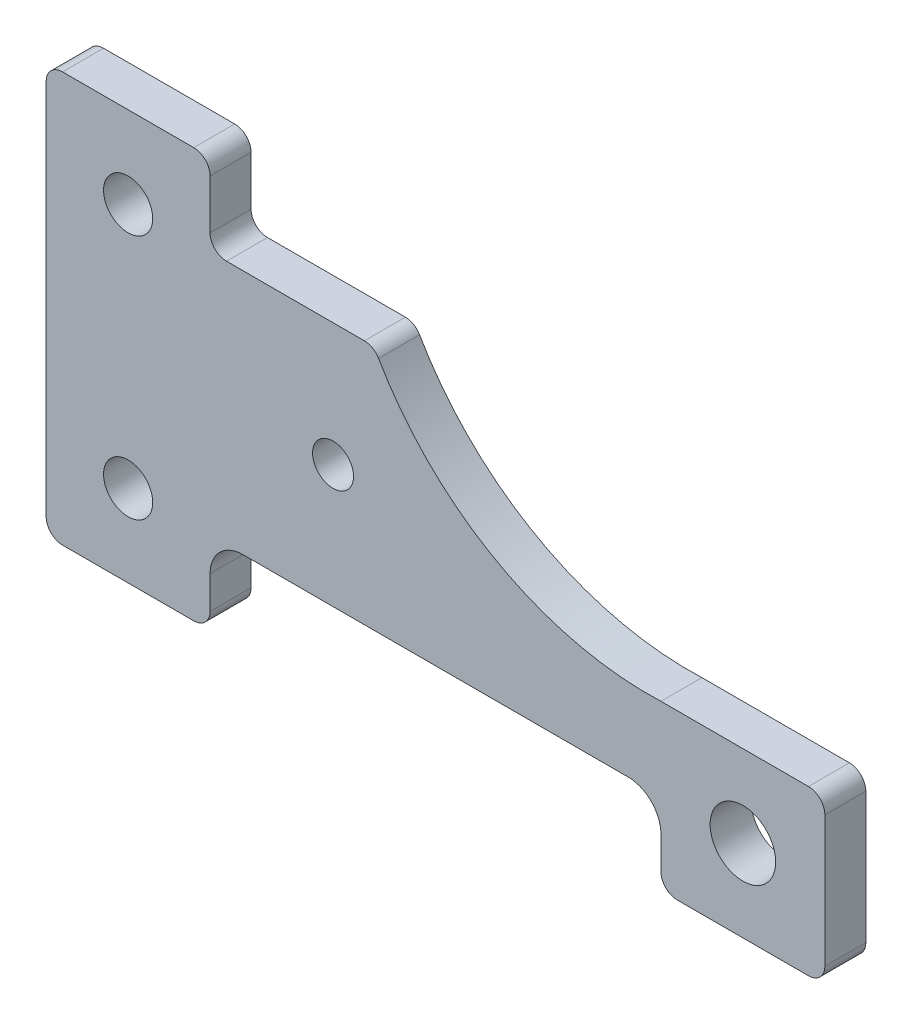
ISO-10303-21;
HEADER;
FILE_DESCRIPTION(('STEP AP214'),'2;1');
FILE_NAME('part.step','',(''),(''),'','','');
FILE_SCHEMA(('AUTOMOTIVE_DESIGN { 1 0 10303 214 1 1 1 1 }'));
ENDSEC;
DATA;
#1=APPLICATION_CONTEXT('core data for automotive mechanical design processes');
#2=APPLICATION_PROTOCOL_DEFINITION('international standard','automotive_design',2000,#1);
#3=PRODUCT_CONTEXT('',#1,'mechanical');
#4=PRODUCT('Part','Part','',(#3));
#5=PRODUCT_RELATED_PRODUCT_CATEGORY('part','',(#4));
#6=PRODUCT_DEFINITION_FORMATION('','',#4);
#7=PRODUCT_DEFINITION_CONTEXT('part definition',#1,'design');
#8=PRODUCT_DEFINITION('design','',#6,#7);
#9=PRODUCT_DEFINITION_SHAPE('','',#8);
#10=(LENGTH_UNIT() NAMED_UNIT(*) SI_UNIT(.MILLI.,.METRE.));
#11=(NAMED_UNIT(*) PLANE_ANGLE_UNIT() SI_UNIT($,.RADIAN.));
#12=(NAMED_UNIT(*) SI_UNIT($,.STERADIAN.) SOLID_ANGLE_UNIT());
#13=UNCERTAINTY_MEASURE_WITH_UNIT(LENGTH_MEASURE(1.E-05),#10,'distance_accuracy_value','');
#14=(GEOMETRIC_REPRESENTATION_CONTEXT(3) GLOBAL_UNCERTAINTY_ASSIGNED_CONTEXT((#13)) GLOBAL_UNIT_ASSIGNED_CONTEXT((#10,
#11,#12)) REPRESENTATION_CONTEXT('',''));
#15=CARTESIAN_POINT('',(0.,0.,0.));
#16=DIRECTION('',(0.,0.,1.));
#17=DIRECTION('',(1.,0.,0.));
#18=AXIS2_PLACEMENT_3D('',#15,#16,#17);
#19=CARTESIAN_POINT('',(180.,480.,50.));
#20=DIRECTION('',(0.,0.,1.));
#21=DIRECTION('',(1.,0.,0.));
#22=AXIS2_PLACEMENT_3D('',#19,#20,#21);
#23=PLANE('',#22);
#24=CARTESIAN_POINT('',(350.,250.,50.));
#25=DIRECTION('',(0.,0.,1.));
#26=DIRECTION('',(1.,0.,0.));
#27=AXIS2_PLACEMENT_3D('',#24,#25,#26);
#28=CIRCLE('',#27,25.);
#29=CARTESIAN_POINT('',(375.,250.,50.));
#30=VERTEX_POINT('',#29);
#31=EDGE_CURVE('E434',#30,#30,#28,.T.);
#32=ORIENTED_EDGE('',*,*,#31,.F.);
#33=EDGE_LOOP('',(#32));
#34=FACE_BOUND('',#33,.T.);
#35=CARTESIAN_POINT('',(100.,400.,50.));
#36=DIRECTION('',(0.,0.,1.));
#37=DIRECTION('',(1.,0.,0.));
#38=AXIS2_PLACEMENT_3D('',#35,#36,#37);
#39=CIRCLE('',#38,30.);
#40=CARTESIAN_POINT('',(130.,400.,50.));
#41=VERTEX_POINT('',#40);
#42=EDGE_CURVE('E224',#41,#41,#39,.T.);
#43=ORIENTED_EDGE('',*,*,#42,.F.);
#44=EDGE_LOOP('',(#43));
#45=FACE_BOUND('',#44,.T.);
#46=CARTESIAN_POINT('',(180.,480.,50.));
#47=DIRECTION('',(0.,0.,1.));
#48=DIRECTION('',(1.,0.,0.));
#49=AXIS2_PLACEMENT_3D('',#46,#47,#48);
#50=CIRCLE('',#49,20.);
#51=CARTESIAN_POINT('',(200.,480.,50.));
#52=VERTEX_POINT('',#51);
#53=CARTESIAN_POINT('',(180.,500.,50.));
#54=VERTEX_POINT('',#53);
#55=EDGE_CURVE('E265',#52,#54,#50,.T.);
#56=ORIENTED_EDGE('',*,*,#55,.T.);
#57=DIRECTION('',(-1.,0.,0.));
#58=VECTOR('',#57,1.);
#59=CARTESIAN_POINT('',(20.0000000000001,500.,50.));
#60=LINE('',#59,#58);
#61=CARTESIAN_POINT('',(20.0000000000001,500.,50.));
#62=VERTEX_POINT('',#61);
#63=EDGE_CURVE('E138',#54,#62,#60,.T.);
#64=ORIENTED_EDGE('',*,*,#63,.T.);
#65=CARTESIAN_POINT('',(20.,480.,50.));
#66=DIRECTION('',(0.,0.,1.));
#67=DIRECTION('',(-1.,0.,0.));
#68=AXIS2_PLACEMENT_3D('',#65,#66,#67);
#69=CIRCLE('',#68,20.);
#70=CARTESIAN_POINT('',(0.,480.,50.));
#71=VERTEX_POINT('',#70);
#72=EDGE_CURVE('E325',#62,#71,#69,.T.);
#73=ORIENTED_EDGE('',*,*,#72,.T.);
#74=DIRECTION('',(0.,-1.,0.));
#75=VECTOR('',#74,1.);
#76=CARTESIAN_POINT('',(0.,20.0000000000001,50.));
#77=LINE('',#76,#75);
#78=CARTESIAN_POINT('',(0.,20.,50.));
#79=VERTEX_POINT('',#78);
#80=EDGE_CURVE('E344',#71,#79,#77,.T.);
#81=ORIENTED_EDGE('',*,*,#80,.T.);
#82=CARTESIAN_POINT('',(20.,20.,50.));
#83=DIRECTION('',(0.,0.,1.));
#84=DIRECTION('',(-1.,0.,0.));
#85=AXIS2_PLACEMENT_3D('',#82,#83,#84);
#86=CIRCLE('',#85,20.);
#87=CARTESIAN_POINT('',(20.0000000000001,0.,50.));
#88=VERTEX_POINT('',#87);
#89=EDGE_CURVE('E341',#79,#88,#86,.T.);
#90=ORIENTED_EDGE('',*,*,#89,.T.);
#91=DIRECTION('',(1.,0.,0.));
#92=VECTOR('',#91,1.);
#93=CARTESIAN_POINT('',(20.0000000000001,0.,50.));
#94=LINE('',#93,#92);
#95=CARTESIAN_POINT('',(180.,0.,50.));
#96=VERTEX_POINT('',#95);
#97=EDGE_CURVE('E343',#88,#96,#94,.T.);
#98=ORIENTED_EDGE('',*,*,#97,.T.);
#99=CARTESIAN_POINT('',(180.,20.,50.));
#100=DIRECTION('',(0.,0.,1.));
#101=DIRECTION('',(-1.,0.,0.));
#102=AXIS2_PLACEMENT_3D('',#99,#100,#101);
#103=CIRCLE('',#102,20.);
#104=CARTESIAN_POINT('',(200.,20.0000000000001,50.));
#105=VERTEX_POINT('',#104);
#106=EDGE_CURVE('E346',#96,#105,#103,.T.);
#107=ORIENTED_EDGE('',*,*,#106,.T.);
#108=DIRECTION('',(0.,1.,0.));
#109=VECTOR('',#108,1.);
#110=CARTESIAN_POINT('',(200.,20.0000000000001,50.));
#111=LINE('',#110,#109);
#112=CARTESIAN_POINT('',(200.,59.9999999999997,50.));
#113=VERTEX_POINT('',#112);
#114=EDGE_CURVE('E352',#105,#113,#111,.T.);
#115=ORIENTED_EDGE('',*,*,#114,.T.);
#116=CARTESIAN_POINT('',(240.,60.,50.));
#117=DIRECTION('',(0.,0.,-1.));
#118=DIRECTION('',(-1.,0.,0.));
#119=AXIS2_PLACEMENT_3D('',#116,#117,#118);
#120=CIRCLE('',#119,40.);
#121=CARTESIAN_POINT('',(240.,100.,50.));
#122=VERTEX_POINT('',#121);
#123=EDGE_CURVE('E354',#113,#122,#120,.T.);
#124=ORIENTED_EDGE('',*,*,#123,.T.);
#125=DIRECTION('',(1.,0.,0.));
#126=VECTOR('',#125,1.);
#127=CARTESIAN_POINT('',(240.,100.,50.));
#128=LINE('',#127,#126);
#129=CARTESIAN_POINT('',(710.,100.,50.));
#130=VERTEX_POINT('',#129);
#131=EDGE_CURVE('E356',#122,#130,#128,.T.);
#132=ORIENTED_EDGE('',*,*,#131,.T.);
#133=CARTESIAN_POINT('',(710.,60.,50.));
#134=DIRECTION('',(0.,0.,-1.));
#135=DIRECTION('',(-1.,0.,0.));
#136=AXIS2_PLACEMENT_3D('',#133,#134,#135);
#137=CIRCLE('',#136,40.);
#138=CARTESIAN_POINT('',(750.,59.9999999999997,50.));
#139=VERTEX_POINT('',#138);
#140=EDGE_CURVE('E358',#130,#139,#137,.T.);
#141=ORIENTED_EDGE('',*,*,#140,.T.);
#142=DIRECTION('',(0.,-1.,0.));
#143=VECTOR('',#142,1.);
#144=CARTESIAN_POINT('',(750.,59.9999999999997,50.));
#145=LINE('',#144,#143);
#146=CARTESIAN_POINT('',(750.,20.0000000000001,50.));
#147=VERTEX_POINT('',#146);
#148=EDGE_CURVE('E360',#139,#147,#145,.T.);
#149=ORIENTED_EDGE('',*,*,#148,.T.);
#150=CARTESIAN_POINT('',(770.,20.,50.));
#151=DIRECTION('',(0.,0.,1.));
#152=DIRECTION('',(1.,0.,0.));
#153=AXIS2_PLACEMENT_3D('',#150,#151,#152);
#154=CIRCLE('',#153,20.);
#155=CARTESIAN_POINT('',(770.,0.,50.));
#156=VERTEX_POINT('',#155);
#157=EDGE_CURVE('E362',#147,#156,#154,.T.);
#158=ORIENTED_EDGE('',*,*,#157,.T.);
#159=DIRECTION('',(1.,0.,0.));
#160=VECTOR('',#159,1.);
#161=CARTESIAN_POINT('',(770.,0.,50.));
#162=LINE('',#161,#160);
#163=CARTESIAN_POINT('',(930.,0.,50.));
#164=VERTEX_POINT('',#163);
#165=EDGE_CURVE('E364',#156,#164,#162,.T.);
#166=ORIENTED_EDGE('',*,*,#165,.T.);
#167=CARTESIAN_POINT('',(930.,20.,50.));
#168=DIRECTION('',(0.,0.,1.));
#169=DIRECTION('',(1.,0.,0.));
#170=AXIS2_PLACEMENT_3D('',#167,#168,#169);
#171=CIRCLE('',#170,20.);
#172=CARTESIAN_POINT('',(950.,20.0000000000001,50.));
#173=VERTEX_POINT('',#172);
#174=EDGE_CURVE('E366',#164,#173,#171,.T.);
#175=ORIENTED_EDGE('',*,*,#174,.T.);
#176=DIRECTION('',(0.,1.,0.));
#177=VECTOR('',#176,1.);
#178=CARTESIAN_POINT('',(950.,20.0000000000001,50.));
#179=LINE('',#178,#177);
#180=CARTESIAN_POINT('',(950.,180.,50.));
#181=VERTEX_POINT('',#180);
#182=EDGE_CURVE('E368',#173,#181,#179,.T.);
#183=ORIENTED_EDGE('',*,*,#182,.T.);
#184=CARTESIAN_POINT('',(930.,180.,50.));
#185=DIRECTION('',(0.,0.,1.));
#186=DIRECTION('',(1.,0.,0.));
#187=AXIS2_PLACEMENT_3D('',#184,#185,#186);
#188=CIRCLE('',#187,20.);
#189=CARTESIAN_POINT('',(930.,200.,50.));
#190=VERTEX_POINT('',#189);
#191=EDGE_CURVE('E370',#181,#190,#188,.T.);
#192=ORIENTED_EDGE('',*,*,#191,.T.);
#193=DIRECTION('',(-1.,0.,0.));
#194=VECTOR('',#193,1.);
#195=CARTESIAN_POINT('',(930.,200.,50.));
#196=LINE('',#195,#194);
#197=CARTESIAN_POINT('',(750.,200.,50.));
#198=VERTEX_POINT('',#197);
#199=EDGE_CURVE('E372',#190,#198,#196,.T.);
#200=ORIENTED_EDGE('',*,*,#199,.T.);
#201=CARTESIAN_POINT('',(734.826829364207,579.696951387362,50.));
#202=DIRECTION('',(0.,0.,-1.));
#203=DIRECTION('',(1.,0.,0.));
#204=AXIS2_PLACEMENT_3D('',#201,#202,#203);
#205=CIRCLE('',#204,380.);
#206=CARTESIAN_POINT('',(405.571126809262,389.984847569368,50.));
#207=VERTEX_POINT('',#206);
#208=EDGE_CURVE('E374',#198,#207,#205,.T.);
#209=ORIENTED_EDGE('',*,*,#208,.T.);
#210=CARTESIAN_POINT('',(388.24187930637,380.,50.));
#211=DIRECTION('',(0.,0.,1.));
#212=DIRECTION('',(-1.,0.,0.));
#213=AXIS2_PLACEMENT_3D('',#210,#211,#212);
#214=CIRCLE('',#213,20.);
#215=CARTESIAN_POINT('',(388.24187930637,400.,50.));
#216=VERTEX_POINT('',#215);
#217=EDGE_CURVE('E202',#207,#216,#214,.T.);
#218=ORIENTED_EDGE('',*,*,#217,.T.);
#219=DIRECTION('',(-1.,0.,0.));
#220=VECTOR('',#219,1.);
#221=CARTESIAN_POINT('',(220.,400.,50.));
#222=LINE('',#221,#220);
#223=CARTESIAN_POINT('',(220.,400.,50.));
#224=VERTEX_POINT('',#223);
#225=EDGE_CURVE('E196',#216,#224,#222,.T.);
#226=ORIENTED_EDGE('',*,*,#225,.T.);
#227=CARTESIAN_POINT('',(220.,420.,50.));
#228=DIRECTION('',(0.,0.,-1.));
#229=DIRECTION('',(1.,0.,0.));
#230=AXIS2_PLACEMENT_3D('',#227,#228,#229);
#231=CIRCLE('',#230,20.);
#232=CARTESIAN_POINT('',(200.,420.,50.));
#233=VERTEX_POINT('',#232);
#234=EDGE_CURVE('E200',#224,#233,#231,.T.);
#235=ORIENTED_EDGE('',*,*,#234,.T.);
#236=DIRECTION('',(0.,1.,0.));
#237=VECTOR('',#236,1.);
#238=CARTESIAN_POINT('',(200.,480.,50.));
#239=LINE('',#238,#237);
#240=EDGE_CURVE('E50',#233,#52,#239,.T.);
#241=ORIENTED_EDGE('',*,*,#240,.T.);
#242=EDGE_LOOP('',(#56,#64,#73,#81,#90,#98,#107,#115,#124,#132,#141,#149,#158,#166,#175,#183,
#192,#200,#209,#218,#226,#235,#241));
#243=FACE_BOUND('',#242,.T.);
#244=CARTESIAN_POINT('',(100.,100.,50.));
#245=DIRECTION('',(0.,0.,1.));
#246=DIRECTION('',(1.,0.,0.));
#247=AXIS2_PLACEMENT_3D('',#244,#245,#246);
#248=CIRCLE('',#247,30.);
#249=CARTESIAN_POINT('',(130.,100.,50.));
#250=VERTEX_POINT('',#249);
#251=EDGE_CURVE('E440',#250,#250,#248,.T.);
#252=ORIENTED_EDGE('',*,*,#251,.F.);
#253=EDGE_LOOP('',(#252));
#254=FACE_BOUND('',#253,.T.);
#255=CARTESIAN_POINT('',(850.,100.,50.));
#256=DIRECTION('',(0.,0.,1.));
#257=DIRECTION('',(1.,0.,0.));
#258=AXIS2_PLACEMENT_3D('',#255,#256,#257);
#259=CIRCLE('',#258,40.);
#260=CARTESIAN_POINT('',(890.,100.,50.));
#261=VERTEX_POINT('',#260);
#262=EDGE_CURVE('E425',#261,#261,#259,.T.);
#263=ORIENTED_EDGE('',*,*,#262,.F.);
#264=EDGE_LOOP('',(#263));
#265=FACE_BOUND('',#264,.T.);
#266=ADVANCED_FACE('F33',(#34,#45,#243,#254,#265),#23,.T.);
#267=CARTESIAN_POINT('',(180.,480.,0.));
#268=DIRECTION('',(0.,0.,1.));
#269=DIRECTION('',(1.,0.,0.));
#270=AXIS2_PLACEMENT_3D('',#267,#268,#269);
#271=PLANE('',#270);
#272=CARTESIAN_POINT('',(180.,480.,0.));
#273=DIRECTION('',(0.,0.,1.));
#274=DIRECTION('',(1.,0.,0.));
#275=AXIS2_PLACEMENT_3D('',#272,#273,#274);
#276=CIRCLE('',#275,20.);
#277=CARTESIAN_POINT('',(200.,480.,0.));
#278=VERTEX_POINT('',#277);
#279=CARTESIAN_POINT('',(180.,500.,0.));
#280=VERTEX_POINT('',#279);
#281=EDGE_CURVE('E220',#278,#280,#276,.T.);
#282=ORIENTED_EDGE('',*,*,#281,.F.);
#283=DIRECTION('',(0.,1.,0.));
#284=VECTOR('',#283,1.);
#285=CARTESIAN_POINT('',(200.,480.,0.));
#286=LINE('',#285,#284);
#287=CARTESIAN_POINT('',(200.,420.,0.));
#288=VERTEX_POINT('',#287);
#289=EDGE_CURVE('E130',#288,#278,#286,.T.);
#290=ORIENTED_EDGE('',*,*,#289,.F.);
#291=CARTESIAN_POINT('',(220.,420.,0.));
#292=DIRECTION('',(0.,0.,-1.));
#293=DIRECTION('',(1.,0.,0.));
#294=AXIS2_PLACEMENT_3D('',#291,#292,#293);
#295=CIRCLE('',#294,20.);
#296=CARTESIAN_POINT('',(220.,400.,0.));
#297=VERTEX_POINT('',#296);
#298=EDGE_CURVE('E124',#297,#288,#295,.T.);
#299=ORIENTED_EDGE('',*,*,#298,.F.);
#300=DIRECTION('',(-1.,0.,0.));
#301=VECTOR('',#300,1.);
#302=CARTESIAN_POINT('',(220.,400.,0.));
#303=LINE('',#302,#301);
#304=CARTESIAN_POINT('',(388.24187930637,400.,0.));
#305=VERTEX_POINT('',#304);
#306=EDGE_CURVE('E210',#305,#297,#303,.T.);
#307=ORIENTED_EDGE('',*,*,#306,.F.);
#308=CARTESIAN_POINT('',(388.24187930637,380.,0.));
#309=DIRECTION('',(0.,0.,1.));
#310=DIRECTION('',(-1.,0.,0.));
#311=AXIS2_PLACEMENT_3D('',#308,#309,#310);
#312=CIRCLE('',#311,20.);
#313=CARTESIAN_POINT('',(405.571126809262,389.984847569368,0.));
#314=VERTEX_POINT('',#313);
#315=EDGE_CURVE('E260',#314,#305,#312,.T.);
#316=ORIENTED_EDGE('',*,*,#315,.F.);
#317=CARTESIAN_POINT('',(734.826829364207,579.696951387362,0.));
#318=DIRECTION('',(0.,0.,-1.));
#319=DIRECTION('',(1.,0.,0.));
#320=AXIS2_PLACEMENT_3D('',#317,#318,#319);
#321=CIRCLE('',#320,380.);
#322=CARTESIAN_POINT('',(750.,200.,0.));
#323=VERTEX_POINT('',#322);
#324=EDGE_CURVE('E258',#323,#314,#321,.T.);
#325=ORIENTED_EDGE('',*,*,#324,.F.);
#326=DIRECTION('',(-1.,0.,0.));
#327=VECTOR('',#326,1.);
#328=CARTESIAN_POINT('',(930.,200.,0.));
#329=LINE('',#328,#327);
#330=CARTESIAN_POINT('',(930.,200.,0.));
#331=VERTEX_POINT('',#330);
#332=EDGE_CURVE('E256',#331,#323,#329,.T.);
#333=ORIENTED_EDGE('',*,*,#332,.F.);
#334=CARTESIAN_POINT('',(930.,180.,0.));
#335=DIRECTION('',(0.,0.,1.));
#336=DIRECTION('',(1.,0.,0.));
#337=AXIS2_PLACEMENT_3D('',#334,#335,#336);
#338=CIRCLE('',#337,20.);
#339=CARTESIAN_POINT('',(950.,180.,0.));
#340=VERTEX_POINT('',#339);
#341=EDGE_CURVE('E254',#340,#331,#338,.T.);
#342=ORIENTED_EDGE('',*,*,#341,.F.);
#343=DIRECTION('',(0.,1.,0.));
#344=VECTOR('',#343,1.);
#345=CARTESIAN_POINT('',(950.,20.0000000000001,0.));
#346=LINE('',#345,#344);
#347=CARTESIAN_POINT('',(950.,20.0000000000001,0.));
#348=VERTEX_POINT('',#347);
#349=EDGE_CURVE('E252',#348,#340,#346,.T.);
#350=ORIENTED_EDGE('',*,*,#349,.F.);
#351=CARTESIAN_POINT('',(930.,20.,0.));
#352=DIRECTION('',(0.,0.,1.));
#353=DIRECTION('',(1.,0.,0.));
#354=AXIS2_PLACEMENT_3D('',#351,#352,#353);
#355=CIRCLE('',#354,20.);
#356=CARTESIAN_POINT('',(930.,0.,0.));
#357=VERTEX_POINT('',#356);
#358=EDGE_CURVE('E250',#357,#348,#355,.T.);
#359=ORIENTED_EDGE('',*,*,#358,.F.);
#360=DIRECTION('',(1.,0.,0.));
#361=VECTOR('',#360,1.);
#362=CARTESIAN_POINT('',(770.,0.,0.));
#363=LINE('',#362,#361);
#364=CARTESIAN_POINT('',(770.,0.,0.));
#365=VERTEX_POINT('',#364);
#366=EDGE_CURVE('E248',#365,#357,#363,.T.);
#367=ORIENTED_EDGE('',*,*,#366,.F.);
#368=CARTESIAN_POINT('',(770.,20.,0.));
#369=DIRECTION('',(0.,0.,1.));
#370=DIRECTION('',(1.,0.,0.));
#371=AXIS2_PLACEMENT_3D('',#368,#369,#370);
#372=CIRCLE('',#371,20.);
#373=CARTESIAN_POINT('',(750.,20.0000000000001,0.));
#374=VERTEX_POINT('',#373);
#375=EDGE_CURVE('E246',#374,#365,#372,.T.);
#376=ORIENTED_EDGE('',*,*,#375,.F.);
#377=DIRECTION('',(0.,-1.,0.));
#378=VECTOR('',#377,1.);
#379=CARTESIAN_POINT('',(750.,59.9999999999997,0.));
#380=LINE('',#379,#378);
#381=CARTESIAN_POINT('',(750.,59.9999999999997,0.));
#382=VERTEX_POINT('',#381);
#383=EDGE_CURVE('E244',#382,#374,#380,.T.);
#384=ORIENTED_EDGE('',*,*,#383,.F.);
#385=CARTESIAN_POINT('',(710.,60.,0.));
#386=DIRECTION('',(0.,0.,-1.));
#387=DIRECTION('',(-1.,0.,0.));
#388=AXIS2_PLACEMENT_3D('',#385,#386,#387);
#389=CIRCLE('',#388,40.);
#390=CARTESIAN_POINT('',(710.,100.,0.));
#391=VERTEX_POINT('',#390);
#392=EDGE_CURVE('E242',#391,#382,#389,.T.);
#393=ORIENTED_EDGE('',*,*,#392,.F.);
#394=DIRECTION('',(1.,0.,0.));
#395=VECTOR('',#394,1.);
#396=CARTESIAN_POINT('',(240.,100.,0.));
#397=LINE('',#396,#395);
#398=CARTESIAN_POINT('',(240.,100.,0.));
#399=VERTEX_POINT('',#398);
#400=EDGE_CURVE('E240',#399,#391,#397,.T.);
#401=ORIENTED_EDGE('',*,*,#400,.F.);
#402=CARTESIAN_POINT('',(240.,60.,0.));
#403=DIRECTION('',(0.,0.,-1.));
#404=DIRECTION('',(-1.,0.,0.));
#405=AXIS2_PLACEMENT_3D('',#402,#403,#404);
#406=CIRCLE('',#405,40.);
#407=CARTESIAN_POINT('',(200.,59.9999999999997,0.));
#408=VERTEX_POINT('',#407);
#409=EDGE_CURVE('E238',#408,#399,#406,.T.);
#410=ORIENTED_EDGE('',*,*,#409,.F.);
#411=DIRECTION('',(0.,1.,0.));
#412=VECTOR('',#411,1.);
#413=CARTESIAN_POINT('',(200.,20.0000000000001,0.));
#414=LINE('',#413,#412);
#415=CARTESIAN_POINT('',(200.,20.0000000000001,0.));
#416=VERTEX_POINT('',#415);
#417=EDGE_CURVE('E236',#416,#408,#414,.T.);
#418=ORIENTED_EDGE('',*,*,#417,.F.);
#419=CARTESIAN_POINT('',(180.,20.,0.));
#420=DIRECTION('',(0.,0.,1.));
#421=DIRECTION('',(-1.,0.,0.));
#422=AXIS2_PLACEMENT_3D('',#419,#420,#421);
#423=CIRCLE('',#422,20.);
#424=CARTESIAN_POINT('',(180.,0.,0.));
#425=VERTEX_POINT('',#424);
#426=EDGE_CURVE('E234',#425,#416,#423,.T.);
#427=ORIENTED_EDGE('',*,*,#426,.F.);
#428=DIRECTION('',(1.,0.,0.));
#429=VECTOR('',#428,1.);
#430=CARTESIAN_POINT('',(20.0000000000001,0.,0.));
#431=LINE('',#430,#429);
#432=CARTESIAN_POINT('',(20.0000000000001,0.,0.));
#433=VERTEX_POINT('',#432);
#434=EDGE_CURVE('E232',#433,#425,#431,.T.);
#435=ORIENTED_EDGE('',*,*,#434,.F.);
#436=CARTESIAN_POINT('',(20.,20.,0.));
#437=DIRECTION('',(0.,0.,1.));
#438=DIRECTION('',(-1.,0.,0.));
#439=AXIS2_PLACEMENT_3D('',#436,#437,#438);
#440=CIRCLE('',#439,20.);
#441=CARTESIAN_POINT('',(0.,20.,0.));
#442=VERTEX_POINT('',#441);
#443=EDGE_CURVE('E230',#442,#433,#440,.T.);
#444=ORIENTED_EDGE('',*,*,#443,.F.);
#445=DIRECTION('',(0.,-1.,0.));
#446=VECTOR('',#445,1.);
#447=CARTESIAN_POINT('',(0.,20.0000000000001,0.));
#448=LINE('',#447,#446);
#449=CARTESIAN_POINT('',(0.,480.,0.));
#450=VERTEX_POINT('',#449);
#451=EDGE_CURVE('E228',#450,#442,#448,.T.);
#452=ORIENTED_EDGE('',*,*,#451,.F.);
#453=CARTESIAN_POINT('',(20.,480.,0.));
#454=DIRECTION('',(0.,0.,1.));
#455=DIRECTION('',(-1.,0.,0.));
#456=AXIS2_PLACEMENT_3D('',#453,#454,#455);
#457=CIRCLE('',#456,20.);
#458=CARTESIAN_POINT('',(20.0000000000001,500.,0.));
#459=VERTEX_POINT('',#458);
#460=EDGE_CURVE('E226',#459,#450,#457,.T.);
#461=ORIENTED_EDGE('',*,*,#460,.F.);
#462=DIRECTION('',(-1.,0.,0.));
#463=VECTOR('',#462,1.);
#464=CARTESIAN_POINT('',(20.0000000000001,500.,0.));
#465=LINE('',#464,#463);
#466=EDGE_CURVE('E223',#280,#459,#465,.T.);
#467=ORIENTED_EDGE('',*,*,#466,.F.);
#468=EDGE_LOOP('',(#282,#290,#299,#307,#316,#325,#333,#342,#350,#359,#367,#376,#384,#393,#401,
#410,#418,#427,#435,#444,#452,#461,#467));
#469=FACE_BOUND('',#468,.T.);
#470=CARTESIAN_POINT('',(100.,400.,0.));
#471=DIRECTION('',(0.,0.,1.));
#472=DIRECTION('',(1.,0.,0.));
#473=AXIS2_PLACEMENT_3D('',#470,#471,#472);
#474=CIRCLE('',#473,30.);
#475=CARTESIAN_POINT('',(130.,400.,0.));
#476=VERTEX_POINT('',#475);
#477=EDGE_CURVE('E443',#476,#476,#474,.T.);
#478=ORIENTED_EDGE('',*,*,#477,.T.);
#479=EDGE_LOOP('',(#478));
#480=FACE_BOUND('',#479,.T.);
#481=CARTESIAN_POINT('',(100.,100.,0.));
#482=DIRECTION('',(0.,0.,1.));
#483=DIRECTION('',(1.,0.,0.));
#484=AXIS2_PLACEMENT_3D('',#481,#482,#483);
#485=CIRCLE('',#484,30.);
#486=CARTESIAN_POINT('',(130.,100.,0.));
#487=VERTEX_POINT('',#486);
#488=EDGE_CURVE('E437',#487,#487,#485,.T.);
#489=ORIENTED_EDGE('',*,*,#488,.T.);
#490=EDGE_LOOP('',(#489));
#491=FACE_BOUND('',#490,.T.);
#492=CARTESIAN_POINT('',(350.,250.,0.));
#493=DIRECTION('',(0.,0.,1.));
#494=DIRECTION('',(1.,0.,0.));
#495=AXIS2_PLACEMENT_3D('',#492,#493,#494);
#496=CIRCLE('',#495,25.);
#497=CARTESIAN_POINT('',(375.,250.,0.));
#498=VERTEX_POINT('',#497);
#499=EDGE_CURVE('E431',#498,#498,#496,.T.);
#500=ORIENTED_EDGE('',*,*,#499,.T.);
#501=EDGE_LOOP('',(#500));
#502=FACE_BOUND('',#501,.T.);
#503=CARTESIAN_POINT('',(850.,100.,0.));
#504=DIRECTION('',(0.,0.,1.));
#505=DIRECTION('',(1.,0.,0.));
#506=AXIS2_PLACEMENT_3D('',#503,#504,#505);
#507=CIRCLE('',#506,40.);
#508=CARTESIAN_POINT('',(890.,100.,0.));
#509=VERTEX_POINT('',#508);
#510=EDGE_CURVE('E428',#509,#509,#507,.T.);
#511=ORIENTED_EDGE('',*,*,#510,.T.);
#512=EDGE_LOOP('',(#511));
#513=FACE_BOUND('',#512,.T.);
#514=ADVANCED_FACE('F329',(#469,#480,#491,#502,#513),#271,.F.);
#515=CARTESIAN_POINT('',(180.,480.,50.));
#516=DIRECTION('',(0.,0.,-1.));
#517=DIRECTION('',(-1.,0.,0.));
#518=AXIS2_PLACEMENT_3D('',#515,#516,#517);
#519=CYLINDRICAL_SURFACE('',#518,20.);
#520=ORIENTED_EDGE('',*,*,#281,.T.);
#521=DIRECTION('',(0.,0.,-1.));
#522=VECTOR('',#521,1.);
#523=CARTESIAN_POINT('',(180.,500.,50.));
#524=LINE('',#523,#522);
#525=EDGE_CURVE('E11',#54,#280,#524,.T.);
#526=ORIENTED_EDGE('',*,*,#525,.F.);
#527=ORIENTED_EDGE('',*,*,#55,.F.);
#528=DIRECTION('',(0.,0.,-1.));
#529=VECTOR('',#528,1.);
#530=CARTESIAN_POINT('',(200.,480.,50.));
#531=LINE('',#530,#529);
#532=EDGE_CURVE('E216',#52,#278,#531,.T.);
#533=ORIENTED_EDGE('',*,*,#532,.T.);
#534=EDGE_LOOP('',(#520,#526,#527,#533));
#535=FACE_BOUND('',#534,.T.);
#536=ADVANCED_FACE('F35',(#535),#519,.T.);
#537=CARTESIAN_POINT('',(20.0000000000001,500.,50.));
#538=DIRECTION('',(0.,-1.,0.));
#539=DIRECTION('',(0.,0.,-1.));
#540=AXIS2_PLACEMENT_3D('',#537,#538,#539);
#541=PLANE('',#540);
#542=ORIENTED_EDGE('',*,*,#466,.T.);
#543=DIRECTION('',(0.,0.,-1.));
#544=VECTOR('',#543,1.);
#545=CARTESIAN_POINT('',(20.0000000000001,500.,50.));
#546=LINE('',#545,#544);
#547=EDGE_CURVE('E42',#62,#459,#546,.T.);
#548=ORIENTED_EDGE('',*,*,#547,.F.);
#549=ORIENTED_EDGE('',*,*,#63,.F.);
#550=ORIENTED_EDGE('',*,*,#525,.T.);
#551=EDGE_LOOP('',(#542,#548,#549,#550));
#552=FACE_BOUND('',#551,.T.);
#553=ADVANCED_FACE('F663',(#552),#541,.F.);
#554=CARTESIAN_POINT('',(20.,480.,50.));
#555=DIRECTION('',(0.,0.,-1.));
#556=DIRECTION('',(-1.,0.,0.));
#557=AXIS2_PLACEMENT_3D('',#554,#555,#556);
#558=CYLINDRICAL_SURFACE('',#557,20.);
#559=ORIENTED_EDGE('',*,*,#460,.T.);
#560=DIRECTION('',(0.,0.,-1.));
#561=VECTOR('',#560,1.);
#562=CARTESIAN_POINT('',(0.,480.,50.));
#563=LINE('',#562,#561);
#564=EDGE_CURVE('E317',#71,#450,#563,.T.);
#565=ORIENTED_EDGE('',*,*,#564,.F.);
#566=ORIENTED_EDGE('',*,*,#72,.F.);
#567=ORIENTED_EDGE('',*,*,#547,.T.);
#568=EDGE_LOOP('',(#559,#565,#566,#567));
#569=FACE_BOUND('',#568,.T.);
#570=ADVANCED_FACE('F323',(#569),#558,.T.);
#571=CARTESIAN_POINT('',(0.,20.0000000000001,50.));
#572=DIRECTION('',(1.,0.,0.));
#573=DIRECTION('',(0.,0.,-1.));
#574=AXIS2_PLACEMENT_3D('',#571,#572,#573);
#575=PLANE('',#574);
#576=ORIENTED_EDGE('',*,*,#451,.T.);
#577=DIRECTION('',(0.,0.,-1.));
#578=VECTOR('',#577,1.);
#579=CARTESIAN_POINT('',(0.,20.,50.));
#580=LINE('',#579,#578);
#581=EDGE_CURVE('E314',#79,#442,#580,.T.);
#582=ORIENTED_EDGE('',*,*,#581,.F.);
#583=ORIENTED_EDGE('',*,*,#80,.F.);
#584=ORIENTED_EDGE('',*,*,#564,.T.);
#585=EDGE_LOOP('',(#576,#582,#583,#584));
#586=FACE_BOUND('',#585,.T.);
#587=ADVANCED_FACE('F335',(#586),#575,.F.);
#588=CARTESIAN_POINT('',(20.,20.,50.));
#589=DIRECTION('',(0.,0.,-1.));
#590=DIRECTION('',(-1.,0.,0.));
#591=AXIS2_PLACEMENT_3D('',#588,#589,#590);
#592=CYLINDRICAL_SURFACE('',#591,20.);
#593=ORIENTED_EDGE('',*,*,#443,.T.);
#594=DIRECTION('',(0.,0.,-1.));
#595=VECTOR('',#594,1.);
#596=CARTESIAN_POINT('',(20.0000000000001,0.,50.));
#597=LINE('',#596,#595);
#598=EDGE_CURVE('E311',#88,#433,#597,.T.);
#599=ORIENTED_EDGE('',*,*,#598,.F.);
#600=ORIENTED_EDGE('',*,*,#89,.F.);
#601=ORIENTED_EDGE('',*,*,#581,.T.);
#602=EDGE_LOOP('',(#593,#599,#600,#601));
#603=FACE_BOUND('',#602,.T.);
#604=ADVANCED_FACE('F339',(#603),#592,.T.);
#605=CARTESIAN_POINT('',(20.0000000000001,0.,50.));
#606=DIRECTION('',(0.,1.,0.));
#607=DIRECTION('',(0.,0.,1.));
#608=AXIS2_PLACEMENT_3D('',#605,#606,#607);
#609=PLANE('',#608);
#610=ORIENTED_EDGE('',*,*,#434,.T.);
#611=DIRECTION('',(0.,0.,-1.));
#612=VECTOR('',#611,1.);
#613=CARTESIAN_POINT('',(180.,0.,50.));
#614=LINE('',#613,#612);
#615=EDGE_CURVE('E308',#96,#425,#614,.T.);
#616=ORIENTED_EDGE('',*,*,#615,.F.);
#617=ORIENTED_EDGE('',*,*,#97,.F.);
#618=ORIENTED_EDGE('',*,*,#598,.T.);
#619=EDGE_LOOP('',(#610,#616,#617,#618));
#620=FACE_BOUND('',#619,.T.);
#621=ADVANCED_FACE('F628',(#620),#609,.F.);
#622=CARTESIAN_POINT('',(180.,20.,50.));
#623=DIRECTION('',(0.,0.,-1.));
#624=DIRECTION('',(-1.,0.,0.));
#625=AXIS2_PLACEMENT_3D('',#622,#623,#624);
#626=CYLINDRICAL_SURFACE('',#625,20.);
#627=ORIENTED_EDGE('',*,*,#426,.T.);
#628=DIRECTION('',(0.,0.,-1.));
#629=VECTOR('',#628,1.);
#630=CARTESIAN_POINT('',(200.,20.0000000000001,50.));
#631=LINE('',#630,#629);
#632=EDGE_CURVE('E305',#105,#416,#631,.T.);
#633=ORIENTED_EDGE('',*,*,#632,.F.);
#634=ORIENTED_EDGE('',*,*,#106,.F.);
#635=ORIENTED_EDGE('',*,*,#615,.T.);
#636=EDGE_LOOP('',(#627,#633,#634,#635));
#637=FACE_BOUND('',#636,.T.);
#638=ADVANCED_FACE('F618',(#637),#626,.T.);
#639=CARTESIAN_POINT('',(200.,20.0000000000001,50.));
#640=DIRECTION('',(-1.,0.,0.));
#641=DIRECTION('',(0.,0.,1.));
#642=AXIS2_PLACEMENT_3D('',#639,#640,#641);
#643=PLANE('',#642);
#644=ORIENTED_EDGE('',*,*,#417,.T.);
#645=DIRECTION('',(0.,0.,-1.));
#646=VECTOR('',#645,1.);
#647=CARTESIAN_POINT('',(200.,59.9999999999997,50.));
#648=LINE('',#647,#646);
#649=EDGE_CURVE('E302',#113,#408,#648,.T.);
#650=ORIENTED_EDGE('',*,*,#649,.F.);
#651=ORIENTED_EDGE('',*,*,#114,.F.);
#652=ORIENTED_EDGE('',*,*,#632,.T.);
#653=EDGE_LOOP('',(#644,#650,#651,#652));
#654=FACE_BOUND('',#653,.T.);
#655=ADVANCED_FACE('F608',(#654),#643,.F.);
#656=CARTESIAN_POINT('',(240.,60.,50.));
#657=DIRECTION('',(0.,0.,-1.));
#658=DIRECTION('',(-1.,0.,0.));
#659=AXIS2_PLACEMENT_3D('',#656,#657,#658);
#660=CYLINDRICAL_SURFACE('',#659,40.);
#661=ORIENTED_EDGE('',*,*,#409,.T.);
#662=DIRECTION('',(0.,0.,-1.));
#663=VECTOR('',#662,1.);
#664=CARTESIAN_POINT('',(240.,100.,50.));
#665=LINE('',#664,#663);
#666=EDGE_CURVE('E299',#122,#399,#665,.T.);
#667=ORIENTED_EDGE('',*,*,#666,.F.);
#668=ORIENTED_EDGE('',*,*,#123,.F.);
#669=ORIENTED_EDGE('',*,*,#649,.T.);
#670=EDGE_LOOP('',(#661,#667,#668,#669));
#671=FACE_BOUND('',#670,.T.);
#672=ADVANCED_FACE('F598',(#671),#660,.F.);
#673=CARTESIAN_POINT('',(240.,100.,50.));
#674=DIRECTION('',(0.,1.,0.));
#675=DIRECTION('',(0.,0.,1.));
#676=AXIS2_PLACEMENT_3D('',#673,#674,#675);
#677=PLANE('',#676);
#678=ORIENTED_EDGE('',*,*,#400,.T.);
#679=DIRECTION('',(0.,0.,-1.));
#680=VECTOR('',#679,1.);
#681=CARTESIAN_POINT('',(710.,100.,50.));
#682=LINE('',#681,#680);
#683=EDGE_CURVE('E296',#130,#391,#682,.T.);
#684=ORIENTED_EDGE('',*,*,#683,.F.);
#685=ORIENTED_EDGE('',*,*,#131,.F.);
#686=ORIENTED_EDGE('',*,*,#666,.T.);
#687=EDGE_LOOP('',(#678,#684,#685,#686));
#688=FACE_BOUND('',#687,.T.);
#689=ADVANCED_FACE('F588',(#688),#677,.F.);
#690=CARTESIAN_POINT('',(710.,60.,50.));
#691=DIRECTION('',(0.,0.,-1.));
#692=DIRECTION('',(-1.,0.,0.));
#693=AXIS2_PLACEMENT_3D('',#690,#691,#692);
#694=CYLINDRICAL_SURFACE('',#693,40.);
#695=ORIENTED_EDGE('',*,*,#392,.T.);
#696=DIRECTION('',(0.,0.,-1.));
#697=VECTOR('',#696,1.);
#698=CARTESIAN_POINT('',(750.,59.9999999999997,50.));
#699=LINE('',#698,#697);
#700=EDGE_CURVE('E293',#139,#382,#699,.T.);
#701=ORIENTED_EDGE('',*,*,#700,.F.);
#702=ORIENTED_EDGE('',*,*,#140,.F.);
#703=ORIENTED_EDGE('',*,*,#683,.T.);
#704=EDGE_LOOP('',(#695,#701,#702,#703));
#705=FACE_BOUND('',#704,.T.);
#706=ADVANCED_FACE('F578',(#705),#694,.F.);
#707=CARTESIAN_POINT('',(750.,59.9999999999997,50.));
#708=DIRECTION('',(1.,0.,0.));
#709=DIRECTION('',(0.,0.,-1.));
#710=AXIS2_PLACEMENT_3D('',#707,#708,#709);
#711=PLANE('',#710);
#712=ORIENTED_EDGE('',*,*,#383,.T.);
#713=DIRECTION('',(0.,0.,-1.));
#714=VECTOR('',#713,1.);
#715=CARTESIAN_POINT('',(750.,20.0000000000001,50.));
#716=LINE('',#715,#714);
#717=EDGE_CURVE('E290',#147,#374,#716,.T.);
#718=ORIENTED_EDGE('',*,*,#717,.F.);
#719=ORIENTED_EDGE('',*,*,#148,.F.);
#720=ORIENTED_EDGE('',*,*,#700,.T.);
#721=EDGE_LOOP('',(#712,#718,#719,#720));
#722=FACE_BOUND('',#721,.T.);
#723=ADVANCED_FACE('F568',(#722),#711,.F.);
#724=CARTESIAN_POINT('',(770.,20.,50.));
#725=DIRECTION('',(0.,0.,-1.));
#726=DIRECTION('',(-1.,0.,0.));
#727=AXIS2_PLACEMENT_3D('',#724,#725,#726);
#728=CYLINDRICAL_SURFACE('',#727,20.);
#729=ORIENTED_EDGE('',*,*,#375,.T.);
#730=DIRECTION('',(0.,0.,-1.));
#731=VECTOR('',#730,1.);
#732=CARTESIAN_POINT('',(770.,0.,50.));
#733=LINE('',#732,#731);
#734=EDGE_CURVE('E287',#156,#365,#733,.T.);
#735=ORIENTED_EDGE('',*,*,#734,.F.);
#736=ORIENTED_EDGE('',*,*,#157,.F.);
#737=ORIENTED_EDGE('',*,*,#717,.T.);
#738=EDGE_LOOP('',(#729,#735,#736,#737));
#739=FACE_BOUND('',#738,.T.);
#740=ADVANCED_FACE('F558',(#739),#728,.T.);
#741=CARTESIAN_POINT('',(770.,0.,50.));
#742=DIRECTION('',(0.,1.,0.));
#743=DIRECTION('',(-1.,0.,0.));
#744=AXIS2_PLACEMENT_3D('',#741,#742,#743);
#745=PLANE('',#744);
#746=ORIENTED_EDGE('',*,*,#366,.T.);
#747=DIRECTION('',(0.,0.,-1.));
#748=VECTOR('',#747,1.);
#749=CARTESIAN_POINT('',(930.,0.,50.));
#750=LINE('',#749,#748);
#751=EDGE_CURVE('E284',#164,#357,#750,.T.);
#752=ORIENTED_EDGE('',*,*,#751,.F.);
#753=ORIENTED_EDGE('',*,*,#165,.F.);
#754=ORIENTED_EDGE('',*,*,#734,.T.);
#755=EDGE_LOOP('',(#746,#752,#753,#754));
#756=FACE_BOUND('',#755,.T.);
#757=ADVANCED_FACE('F548',(#756),#745,.F.);
#758=CARTESIAN_POINT('',(930.,20.,50.));
#759=DIRECTION('',(0.,0.,-1.));
#760=DIRECTION('',(-1.,0.,0.));
#761=AXIS2_PLACEMENT_3D('',#758,#759,#760);
#762=CYLINDRICAL_SURFACE('',#761,20.);
#763=ORIENTED_EDGE('',*,*,#358,.T.);
#764=DIRECTION('',(0.,0.,-1.));
#765=VECTOR('',#764,1.);
#766=CARTESIAN_POINT('',(950.,20.0000000000001,50.));
#767=LINE('',#766,#765);
#768=EDGE_CURVE('E281',#173,#348,#767,.T.);
#769=ORIENTED_EDGE('',*,*,#768,.F.);
#770=ORIENTED_EDGE('',*,*,#174,.F.);
#771=ORIENTED_EDGE('',*,*,#751,.T.);
#772=EDGE_LOOP('',(#763,#769,#770,#771));
#773=FACE_BOUND('',#772,.T.);
#774=ADVANCED_FACE('F538',(#773),#762,.T.);
#775=CARTESIAN_POINT('',(950.,20.0000000000001,50.));
#776=DIRECTION('',(-1.,0.,0.));
#777=DIRECTION('',(0.,0.,1.));
#778=AXIS2_PLACEMENT_3D('',#775,#776,#777);
#779=PLANE('',#778);
#780=ORIENTED_EDGE('',*,*,#349,.T.);
#781=DIRECTION('',(0.,0.,-1.));
#782=VECTOR('',#781,1.);
#783=CARTESIAN_POINT('',(950.,180.,50.));
#784=LINE('',#783,#782);
#785=EDGE_CURVE('E278',#181,#340,#784,.T.);
#786=ORIENTED_EDGE('',*,*,#785,.F.);
#787=ORIENTED_EDGE('',*,*,#182,.F.);
#788=ORIENTED_EDGE('',*,*,#768,.T.);
#789=EDGE_LOOP('',(#780,#786,#787,#788));
#790=FACE_BOUND('',#789,.T.);
#791=ADVANCED_FACE('F528',(#790),#779,.F.);
#792=CARTESIAN_POINT('',(930.,180.,50.));
#793=DIRECTION('',(0.,0.,-1.));
#794=DIRECTION('',(-1.,0.,0.));
#795=AXIS2_PLACEMENT_3D('',#792,#793,#794);
#796=CYLINDRICAL_SURFACE('',#795,20.);
#797=ORIENTED_EDGE('',*,*,#341,.T.);
#798=DIRECTION('',(0.,0.,-1.));
#799=VECTOR('',#798,1.);
#800=CARTESIAN_POINT('',(930.,200.,50.));
#801=LINE('',#800,#799);
#802=EDGE_CURVE('E275',#190,#331,#801,.T.);
#803=ORIENTED_EDGE('',*,*,#802,.F.);
#804=ORIENTED_EDGE('',*,*,#191,.F.);
#805=ORIENTED_EDGE('',*,*,#785,.T.);
#806=EDGE_LOOP('',(#797,#803,#804,#805));
#807=FACE_BOUND('',#806,.T.);
#808=ADVANCED_FACE('F518',(#807),#796,.T.);
#809=CARTESIAN_POINT('',(930.,200.,50.));
#810=DIRECTION('',(0.,-1.,0.));
#811=DIRECTION('',(0.,0.,-1.));
#812=AXIS2_PLACEMENT_3D('',#809,#810,#811);
#813=PLANE('',#812);
#814=ORIENTED_EDGE('',*,*,#332,.T.);
#815=DIRECTION('',(0.,0.,-1.));
#816=VECTOR('',#815,1.);
#817=CARTESIAN_POINT('',(750.,200.,50.));
#818=LINE('',#817,#816);
#819=EDGE_CURVE('E272',#198,#323,#818,.T.);
#820=ORIENTED_EDGE('',*,*,#819,.F.);
#821=ORIENTED_EDGE('',*,*,#199,.F.);
#822=ORIENTED_EDGE('',*,*,#802,.T.);
#823=EDGE_LOOP('',(#814,#820,#821,#822));
#824=FACE_BOUND('',#823,.T.);
#825=ADVANCED_FACE('F509',(#824),#813,.F.);
#826=CARTESIAN_POINT('',(734.826829364207,579.696951387362,50.));
#827=DIRECTION('',(0.,0.,-1.));
#828=DIRECTION('',(-1.,0.,0.));
#829=AXIS2_PLACEMENT_3D('',#826,#827,#828);
#830=CYLINDRICAL_SURFACE('',#829,380.);
#831=ORIENTED_EDGE('',*,*,#324,.T.);
#832=DIRECTION('',(0.,0.,-1.));
#833=VECTOR('',#832,1.);
#834=CARTESIAN_POINT('',(405.571126809262,389.984847569368,50.));
#835=LINE('',#834,#833);
#836=EDGE_CURVE('E269',#207,#314,#835,.T.);
#837=ORIENTED_EDGE('',*,*,#836,.F.);
#838=ORIENTED_EDGE('',*,*,#208,.F.);
#839=ORIENTED_EDGE('',*,*,#819,.T.);
#840=EDGE_LOOP('',(#831,#837,#838,#839));
#841=FACE_BOUND('',#840,.T.);
#842=ADVANCED_FACE('F380',(#841),#830,.F.);
#843=CARTESIAN_POINT('',(388.24187930637,380.,50.));
#844=DIRECTION('',(0.,0.,-1.));
#845=DIRECTION('',(-1.,0.,0.));
#846=AXIS2_PLACEMENT_3D('',#843,#844,#845);
#847=CYLINDRICAL_SURFACE('',#846,20.);
#848=ORIENTED_EDGE('',*,*,#315,.T.);
#849=DIRECTION('',(0.,0.,-1.));
#850=VECTOR('',#849,1.);
#851=CARTESIAN_POINT('',(388.24187930637,400.,50.));
#852=LINE('',#851,#850);
#853=EDGE_CURVE('E211',#216,#305,#852,.T.);
#854=ORIENTED_EDGE('',*,*,#853,.F.);
#855=ORIENTED_EDGE('',*,*,#217,.F.);
#856=ORIENTED_EDGE('',*,*,#836,.T.);
#857=EDGE_LOOP('',(#848,#854,#855,#856));
#858=FACE_BOUND('',#857,.T.);
#859=ADVANCED_FACE('F384',(#858),#847,.T.);
#860=CARTESIAN_POINT('',(220.,400.,50.));
#861=DIRECTION('',(0.,-1.,0.));
#862=DIRECTION('',(0.,0.,-1.));
#863=AXIS2_PLACEMENT_3D('',#860,#861,#862);
#864=PLANE('',#863);
#865=ORIENTED_EDGE('',*,*,#306,.T.);
#866=DIRECTION('',(0.,0.,-1.));
#867=VECTOR('',#866,1.);
#868=CARTESIAN_POINT('',(220.,400.,50.));
#869=LINE('',#868,#867);
#870=EDGE_CURVE('E207',#224,#297,#869,.T.);
#871=ORIENTED_EDGE('',*,*,#870,.F.);
#872=ORIENTED_EDGE('',*,*,#225,.F.);
#873=ORIENTED_EDGE('',*,*,#853,.T.);
#874=EDGE_LOOP('',(#865,#871,#872,#873));
#875=FACE_BOUND('',#874,.T.);
#876=ADVANCED_FACE('F208',(#875),#864,.F.);
#877=CARTESIAN_POINT('',(220.,420.,50.));
#878=DIRECTION('',(0.,0.,-1.));
#879=DIRECTION('',(-1.,0.,0.));
#880=AXIS2_PLACEMENT_3D('',#877,#878,#879);
#881=CYLINDRICAL_SURFACE('',#880,20.);
#882=ORIENTED_EDGE('',*,*,#298,.T.);
#883=DIRECTION('',(0.,0.,-1.));
#884=VECTOR('',#883,1.);
#885=CARTESIAN_POINT('',(200.,420.,50.));
#886=LINE('',#885,#884);
#887=EDGE_CURVE('E212',#233,#288,#886,.T.);
#888=ORIENTED_EDGE('',*,*,#887,.F.);
#889=ORIENTED_EDGE('',*,*,#234,.F.);
#890=ORIENTED_EDGE('',*,*,#870,.T.);
#891=EDGE_LOOP('',(#882,#888,#889,#890));
#892=FACE_BOUND('',#891,.T.);
#893=ADVANCED_FACE('F214',(#892),#881,.F.);
#894=CARTESIAN_POINT('',(200.,480.,50.));
#895=DIRECTION('',(-1.,0.,0.));
#896=DIRECTION('',(0.,-1.,0.));
#897=AXIS2_PLACEMENT_3D('',#894,#895,#896);
#898=PLANE('',#897);
#899=ORIENTED_EDGE('',*,*,#289,.T.);
#900=ORIENTED_EDGE('',*,*,#532,.F.);
#901=ORIENTED_EDGE('',*,*,#240,.F.);
#902=ORIENTED_EDGE('',*,*,#887,.T.);
#903=EDGE_LOOP('',(#899,#900,#901,#902));
#904=FACE_BOUND('',#903,.T.);
#905=ADVANCED_FACE('F388',(#904),#898,.F.);
#906=CARTESIAN_POINT('',(100.,400.,50.));
#907=DIRECTION('',(0.,0.,-1.));
#908=DIRECTION('',(-1.,0.,0.));
#909=AXIS2_PLACEMENT_3D('',#906,#907,#908);
#910=CYLINDRICAL_SURFACE('',#909,30.);
#911=ORIENTED_EDGE('',*,*,#42,.T.);
#912=EDGE_LOOP('',(#911));
#913=FACE_BOUND('',#912,.T.);
#914=ORIENTED_EDGE('',*,*,#477,.F.);
#915=EDGE_LOOP('',(#914));
#916=FACE_BOUND('',#915,.T.);
#917=ADVANCED_FACE('F390',(#913,#916),#910,.F.);
#918=CARTESIAN_POINT('',(100.,100.,50.));
#919=DIRECTION('',(0.,0.,-1.));
#920=DIRECTION('',(-1.,0.,0.));
#921=AXIS2_PLACEMENT_3D('',#918,#919,#920);
#922=CYLINDRICAL_SURFACE('',#921,30.);
#923=ORIENTED_EDGE('',*,*,#251,.T.);
#924=EDGE_LOOP('',(#923));
#925=FACE_BOUND('',#924,.T.);
#926=ORIENTED_EDGE('',*,*,#488,.F.);
#927=EDGE_LOOP('',(#926));
#928=FACE_BOUND('',#927,.T.);
#929=ADVANCED_FACE('F396',(#925,#928),#922,.F.);
#930=CARTESIAN_POINT('',(350.,250.,50.));
#931=DIRECTION('',(0.,0.,-1.));
#932=DIRECTION('',(-1.,0.,0.));
#933=AXIS2_PLACEMENT_3D('',#930,#931,#932);
#934=CYLINDRICAL_SURFACE('',#933,25.);
#935=ORIENTED_EDGE('',*,*,#31,.T.);
#936=EDGE_LOOP('',(#935));
#937=FACE_BOUND('',#936,.T.);
#938=ORIENTED_EDGE('',*,*,#499,.F.);
#939=EDGE_LOOP('',(#938));
#940=FACE_BOUND('',#939,.T.);
#941=ADVANCED_FACE('F412',(#937,#940),#934,.F.);
#942=CARTESIAN_POINT('',(850.,100.,50.));
#943=DIRECTION('',(0.,0.,-1.));
#944=DIRECTION('',(-1.,0.,0.));
#945=AXIS2_PLACEMENT_3D('',#942,#943,#944);
#946=CYLINDRICAL_SURFACE('',#945,40.);
#947=ORIENTED_EDGE('',*,*,#262,.T.);
#948=EDGE_LOOP('',(#947));
#949=FACE_BOUND('',#948,.T.);
#950=ORIENTED_EDGE('',*,*,#510,.F.);
#951=EDGE_LOOP('',(#950));
#952=FACE_BOUND('',#951,.T.);
#953=ADVANCED_FACE('F416',(#949,#952),#946,.F.);
#954=CLOSED_SHELL('',(#266,#514,#536,#553,#570,#587,#604,#621,#638,#655,#672,#689,#706,#723,
#740,#757,#774,#791,#808,#825,#842,#859,#876,#893,#905,#917,#929,#941,#953));
#955=MANIFOLD_SOLID_BREP('B2',#954);
#956=ADVANCED_BREP_SHAPE_REPRESENTATION('',(#18,#955),#14);
#957=SHAPE_DEFINITION_REPRESENTATION(#9,#956);
ENDSEC;
END-ISO-10303-21;
